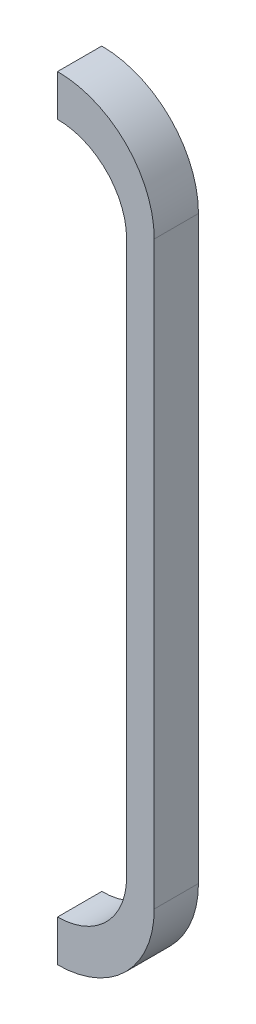
ISO-10303-21;
HEADER;
FILE_DESCRIPTION(('STEP AP214'),'2;1');
FILE_NAME('part.step','',(''),(''),'','','');
FILE_SCHEMA(('AUTOMOTIVE_DESIGN { 1 0 10303 214 1 1 1 1 }'));
ENDSEC;
DATA;
#1=APPLICATION_CONTEXT('core data for automotive mechanical design processes');
#2=APPLICATION_PROTOCOL_DEFINITION('international standard','automotive_design',2000,#1);
#3=PRODUCT_CONTEXT('',#1,'mechanical');
#4=PRODUCT('Part','Part','',(#3));
#5=PRODUCT_RELATED_PRODUCT_CATEGORY('part','',(#4));
#6=PRODUCT_DEFINITION_FORMATION('','',#4);
#7=PRODUCT_DEFINITION_CONTEXT('part definition',#1,'design');
#8=PRODUCT_DEFINITION('design','',#6,#7);
#9=PRODUCT_DEFINITION_SHAPE('','',#8);
#10=(LENGTH_UNIT() NAMED_UNIT(*) SI_UNIT(.MILLI.,.METRE.));
#11=(NAMED_UNIT(*) PLANE_ANGLE_UNIT() SI_UNIT($,.RADIAN.));
#12=(NAMED_UNIT(*) SI_UNIT($,.STERADIAN.) SOLID_ANGLE_UNIT());
#13=UNCERTAINTY_MEASURE_WITH_UNIT(LENGTH_MEASURE(1.E-05),#10,'distance_accuracy_value','');
#14=(GEOMETRIC_REPRESENTATION_CONTEXT(3) GLOBAL_UNCERTAINTY_ASSIGNED_CONTEXT((#13)) GLOBAL_UNIT_ASSIGNED_CONTEXT((#10,
#11,#12)) REPRESENTATION_CONTEXT('',''));
#15=CARTESIAN_POINT('',(0.,0.,0.));
#16=DIRECTION('',(0.,0.,1.));
#17=DIRECTION('',(1.,0.,0.));
#18=AXIS2_PLACEMENT_3D('',#15,#16,#17);
#19=CARTESIAN_POINT('',(10.,-10.5,1.6));
#20=DIRECTION('',(0.,0.,-1.));
#21=DIRECTION('',(-1.,0.,0.));
#22=AXIS2_PLACEMENT_3D('',#19,#20,#21);
#23=CYLINDRICAL_SURFACE('',#22,3.5);
#24=CARTESIAN_POINT('',(10.,-10.5,0.));
#25=DIRECTION('',(0.,0.,1.));
#26=DIRECTION('',(1.,0.,0.));
#27=AXIS2_PLACEMENT_3D('',#24,#25,#26);
#28=CIRCLE('',#27,3.5);
#29=CARTESIAN_POINT('',(9.99999999999997,-14.,0.));
#30=VERTEX_POINT('',#29);
#31=CARTESIAN_POINT('',(13.5,-10.5,0.));
#32=VERTEX_POINT('',#31);
#33=EDGE_CURVE('E129',#30,#32,#28,.T.);
#34=ORIENTED_EDGE('',*,*,#33,.T.);
#35=DIRECTION('',(0.,0.,-1.));
#36=VECTOR('',#35,1.);
#37=CARTESIAN_POINT('',(13.5,-10.5,1.6));
#38=LINE('',#37,#36);
#39=CARTESIAN_POINT('',(13.5,-10.5,1.6));
#40=VERTEX_POINT('',#39);
#41=EDGE_CURVE('E11',#40,#32,#38,.T.);
#42=ORIENTED_EDGE('',*,*,#41,.F.);
#43=CARTESIAN_POINT('',(10.,-10.5,1.6));
#44=DIRECTION('',(0.,0.,1.));
#45=DIRECTION('',(1.,0.,0.));
#46=AXIS2_PLACEMENT_3D('',#43,#44,#45);
#47=CIRCLE('',#46,3.5);
#48=CARTESIAN_POINT('',(9.99999999999997,-14.,1.6));
#49=VERTEX_POINT('',#48);
#50=EDGE_CURVE('E143',#49,#40,#47,.T.);
#51=ORIENTED_EDGE('',*,*,#50,.F.);
#52=DIRECTION('',(0.,0.,-1.));
#53=VECTOR('',#52,1.);
#54=CARTESIAN_POINT('',(9.99999999999997,-14.,1.6));
#55=LINE('',#54,#53);
#56=EDGE_CURVE('E125',#49,#30,#55,.T.);
#57=ORIENTED_EDGE('',*,*,#56,.T.);
#58=EDGE_LOOP('',(#34,#42,#51,#57));
#59=FACE_BOUND('',#58,.T.);
#60=ADVANCED_FACE('F33',(#59),#23,.T.);
#61=CARTESIAN_POINT('',(13.5,10.5,1.6));
#62=DIRECTION('',(-1.,0.,0.));
#63=DIRECTION('',(0.,-1.,0.));
#64=AXIS2_PLACEMENT_3D('',#61,#62,#63);
#65=PLANE('',#64);
#66=DIRECTION('',(0.,1.,0.));
#67=VECTOR('',#66,1.);
#68=CARTESIAN_POINT('',(13.5,10.5,0.));
#69=LINE('',#68,#67);
#70=CARTESIAN_POINT('',(13.5,10.5,0.));
#71=VERTEX_POINT('',#70);
#72=EDGE_CURVE('E132',#32,#71,#69,.T.);
#73=ORIENTED_EDGE('',*,*,#72,.T.);
#74=DIRECTION('',(0.,0.,-1.));
#75=VECTOR('',#74,1.);
#76=CARTESIAN_POINT('',(13.5,10.5,1.6));
#77=LINE('',#76,#75);
#78=CARTESIAN_POINT('',(13.5,10.5,1.6));
#79=VERTEX_POINT('',#78);
#80=EDGE_CURVE('E41',#79,#71,#77,.T.);
#81=ORIENTED_EDGE('',*,*,#80,.F.);
#82=DIRECTION('',(0.,1.,0.));
#83=VECTOR('',#82,1.);
#84=CARTESIAN_POINT('',(13.5,10.5,1.6));
#85=LINE('',#84,#83);
#86=EDGE_CURVE('E92',#40,#79,#85,.T.);
#87=ORIENTED_EDGE('',*,*,#86,.F.);
#88=ORIENTED_EDGE('',*,*,#41,.T.);
#89=EDGE_LOOP('',(#73,#81,#87,#88));
#90=FACE_BOUND('',#89,.T.);
#91=ADVANCED_FACE('F178',(#90),#65,.F.);
#92=CARTESIAN_POINT('',(10.,10.5,1.6));
#93=DIRECTION('',(0.,0.,-1.));
#94=DIRECTION('',(-1.,0.,0.));
#95=AXIS2_PLACEMENT_3D('',#92,#93,#94);
#96=CYLINDRICAL_SURFACE('',#95,3.5);
#97=CARTESIAN_POINT('',(10.,10.5,0.));
#98=DIRECTION('',(0.,0.,1.));
#99=DIRECTION('',(1.,0.,0.));
#100=AXIS2_PLACEMENT_3D('',#97,#98,#99);
#101=CIRCLE('',#100,3.5);
#102=CARTESIAN_POINT('',(10.,14.,0.));
#103=VERTEX_POINT('',#102);
#104=EDGE_CURVE('E134',#71,#103,#101,.T.);
#105=ORIENTED_EDGE('',*,*,#104,.T.);
#106=DIRECTION('',(0.,0.,-1.));
#107=VECTOR('',#106,1.);
#108=CARTESIAN_POINT('',(10.,14.,1.6));
#109=LINE('',#108,#107);
#110=CARTESIAN_POINT('',(10.,14.,1.6));
#111=VERTEX_POINT('',#110);
#112=EDGE_CURVE('E150',#111,#103,#109,.T.);
#113=ORIENTED_EDGE('',*,*,#112,.F.);
#114=CARTESIAN_POINT('',(10.,10.5,1.6));
#115=DIRECTION('',(0.,0.,1.));
#116=DIRECTION('',(1.,0.,0.));
#117=AXIS2_PLACEMENT_3D('',#114,#115,#116);
#118=CIRCLE('',#117,3.5);
#119=EDGE_CURVE('E158',#79,#111,#118,.T.);
#120=ORIENTED_EDGE('',*,*,#119,.F.);
#121=ORIENTED_EDGE('',*,*,#80,.T.);
#122=EDGE_LOOP('',(#105,#113,#120,#121));
#123=FACE_BOUND('',#122,.T.);
#124=ADVANCED_FACE('F156',(#123),#96,.T.);
#125=CARTESIAN_POINT('',(10.,12.5,1.6));
#126=DIRECTION('',(1.,0.,0.));
#127=DIRECTION('',(0.,1.,0.));
#128=AXIS2_PLACEMENT_3D('',#125,#126,#127);
#129=PLANE('',#128);
#130=DIRECTION('',(0.,-1.,0.));
#131=VECTOR('',#130,1.);
#132=CARTESIAN_POINT('',(10.,12.5,0.));
#133=LINE('',#132,#131);
#134=CARTESIAN_POINT('',(10.,12.5,0.));
#135=VERTEX_POINT('',#134);
#136=EDGE_CURVE('E136',#103,#135,#133,.T.);
#137=ORIENTED_EDGE('',*,*,#136,.T.);
#138=DIRECTION('',(0.,0.,-1.));
#139=VECTOR('',#138,1.);
#140=CARTESIAN_POINT('',(10.,12.5,1.6));
#141=LINE('',#140,#139);
#142=CARTESIAN_POINT('',(10.,12.5,1.6));
#143=VERTEX_POINT('',#142);
#144=EDGE_CURVE('E147',#143,#135,#141,.T.);
#145=ORIENTED_EDGE('',*,*,#144,.F.);
#146=DIRECTION('',(0.,-1.,0.));
#147=VECTOR('',#146,1.);
#148=CARTESIAN_POINT('',(10.,12.5,1.6));
#149=LINE('',#148,#147);
#150=EDGE_CURVE('E170',#111,#143,#149,.T.);
#151=ORIENTED_EDGE('',*,*,#150,.F.);
#152=ORIENTED_EDGE('',*,*,#112,.T.);
#153=EDGE_LOOP('',(#137,#145,#151,#152));
#154=FACE_BOUND('',#153,.T.);
#155=ADVANCED_FACE('F166',(#154),#129,.F.);
#156=CARTESIAN_POINT('',(10.,10.,1.6));
#157=DIRECTION('',(0.,0.,-1.));
#158=DIRECTION('',(-1.,0.,0.));
#159=AXIS2_PLACEMENT_3D('',#156,#157,#158);
#160=CYLINDRICAL_SURFACE('',#159,2.5);
#161=CARTESIAN_POINT('',(10.,10.,0.));
#162=DIRECTION('',(0.,0.,-1.));
#163=DIRECTION('',(1.,0.,0.));
#164=AXIS2_PLACEMENT_3D('',#161,#162,#163);
#165=CIRCLE('',#164,2.5);
#166=CARTESIAN_POINT('',(12.5,10.,0.));
#167=VERTEX_POINT('',#166);
#168=EDGE_CURVE('E138',#135,#167,#165,.T.);
#169=ORIENTED_EDGE('',*,*,#168,.T.);
#170=DIRECTION('',(0.,0.,-1.));
#171=VECTOR('',#170,1.);
#172=CARTESIAN_POINT('',(12.5,10.,1.6));
#173=LINE('',#172,#171);
#174=CARTESIAN_POINT('',(12.5,10.,1.6));
#175=VERTEX_POINT('',#174);
#176=EDGE_CURVE('E120',#175,#167,#173,.T.);
#177=ORIENTED_EDGE('',*,*,#176,.F.);
#178=CARTESIAN_POINT('',(10.,10.,1.6));
#179=DIRECTION('',(0.,0.,-1.));
#180=DIRECTION('',(1.,0.,0.));
#181=AXIS2_PLACEMENT_3D('',#178,#179,#180);
#182=CIRCLE('',#181,2.5);
#183=EDGE_CURVE('E111',#143,#175,#182,.T.);
#184=ORIENTED_EDGE('',*,*,#183,.F.);
#185=ORIENTED_EDGE('',*,*,#144,.T.);
#186=EDGE_LOOP('',(#169,#177,#184,#185));
#187=FACE_BOUND('',#186,.T.);
#188=ADVANCED_FACE('F169',(#187),#160,.F.);
#189=CARTESIAN_POINT('',(12.5,-10.,1.6));
#190=DIRECTION('',(1.,0.,0.));
#191=DIRECTION('',(0.,1.,0.));
#192=AXIS2_PLACEMENT_3D('',#189,#190,#191);
#193=PLANE('',#192);
#194=DIRECTION('',(0.,-1.,0.));
#195=VECTOR('',#194,1.);
#196=CARTESIAN_POINT('',(12.5,-10.,0.));
#197=LINE('',#196,#195);
#198=CARTESIAN_POINT('',(12.5,-10.,0.));
#199=VERTEX_POINT('',#198);
#200=EDGE_CURVE('E119',#167,#199,#197,.T.);
#201=ORIENTED_EDGE('',*,*,#200,.T.);
#202=DIRECTION('',(0.,0.,-1.));
#203=VECTOR('',#202,1.);
#204=CARTESIAN_POINT('',(12.5,-10.,1.6));
#205=LINE('',#204,#203);
#206=CARTESIAN_POINT('',(12.5,-10.,1.6));
#207=VERTEX_POINT('',#206);
#208=EDGE_CURVE('E116',#207,#199,#205,.T.);
#209=ORIENTED_EDGE('',*,*,#208,.F.);
#210=DIRECTION('',(0.,-1.,0.));
#211=VECTOR('',#210,1.);
#212=CARTESIAN_POINT('',(12.5,-10.,1.6));
#213=LINE('',#212,#211);
#214=EDGE_CURVE('E105',#175,#207,#213,.T.);
#215=ORIENTED_EDGE('',*,*,#214,.F.);
#216=ORIENTED_EDGE('',*,*,#176,.T.);
#217=EDGE_LOOP('',(#201,#209,#215,#216));
#218=FACE_BOUND('',#217,.T.);
#219=ADVANCED_FACE('F117',(#218),#193,.F.);
#220=CARTESIAN_POINT('',(10.,-10.,1.6));
#221=DIRECTION('',(0.,0.,-1.));
#222=DIRECTION('',(-1.,0.,0.));
#223=AXIS2_PLACEMENT_3D('',#220,#221,#222);
#224=CYLINDRICAL_SURFACE('',#223,2.5);
#225=CARTESIAN_POINT('',(10.,-10.,0.));
#226=DIRECTION('',(0.,0.,-1.));
#227=DIRECTION('',(1.,0.,0.));
#228=AXIS2_PLACEMENT_3D('',#225,#226,#227);
#229=CIRCLE('',#228,2.5);
#230=CARTESIAN_POINT('',(10.,-12.5,0.));
#231=VERTEX_POINT('',#230);
#232=EDGE_CURVE('E78',#199,#231,#229,.T.);
#233=ORIENTED_EDGE('',*,*,#232,.T.);
#234=DIRECTION('',(0.,0.,-1.));
#235=VECTOR('',#234,1.);
#236=CARTESIAN_POINT('',(10.,-12.5,1.6));
#237=LINE('',#236,#235);
#238=CARTESIAN_POINT('',(10.,-12.5,1.6));
#239=VERTEX_POINT('',#238);
#240=EDGE_CURVE('E121',#239,#231,#237,.T.);
#241=ORIENTED_EDGE('',*,*,#240,.F.);
#242=CARTESIAN_POINT('',(10.,-10.,1.6));
#243=DIRECTION('',(0.,0.,-1.));
#244=DIRECTION('',(1.,0.,0.));
#245=AXIS2_PLACEMENT_3D('',#242,#243,#244);
#246=CIRCLE('',#245,2.5);
#247=EDGE_CURVE('E109',#207,#239,#246,.T.);
#248=ORIENTED_EDGE('',*,*,#247,.F.);
#249=ORIENTED_EDGE('',*,*,#208,.T.);
#250=EDGE_LOOP('',(#233,#241,#248,#249));
#251=FACE_BOUND('',#250,.T.);
#252=ADVANCED_FACE('F123',(#251),#224,.F.);
#253=CARTESIAN_POINT('',(9.99999999999997,-14.,1.6));
#254=DIRECTION('',(1.,0.,0.));
#255=DIRECTION('',(0.,1.,0.));
#256=AXIS2_PLACEMENT_3D('',#253,#254,#255);
#257=PLANE('',#256);
#258=DIRECTION('',(0.,-1.,0.));
#259=VECTOR('',#258,1.);
#260=CARTESIAN_POINT('',(9.99999999999997,-14.,0.));
#261=LINE('',#260,#259);
#262=EDGE_CURVE('E84',#231,#30,#261,.T.);
#263=ORIENTED_EDGE('',*,*,#262,.T.);
#264=ORIENTED_EDGE('',*,*,#56,.F.);
#265=DIRECTION('',(0.,-1.,0.));
#266=VECTOR('',#265,1.);
#267=CARTESIAN_POINT('',(9.99999999999997,-14.,1.6));
#268=LINE('',#267,#266);
#269=EDGE_CURVE('E49',#239,#49,#268,.T.);
#270=ORIENTED_EDGE('',*,*,#269,.F.);
#271=ORIENTED_EDGE('',*,*,#240,.T.);
#272=EDGE_LOOP('',(#263,#264,#270,#271));
#273=FACE_BOUND('',#272,.T.);
#274=ADVANCED_FACE('F194',(#273),#257,.F.);
#275=CARTESIAN_POINT('',(10.,-10.5,1.6));
#276=DIRECTION('',(0.,0.,1.));
#277=DIRECTION('',(1.,0.,0.));
#278=AXIS2_PLACEMENT_3D('',#275,#276,#277);
#279=PLANE('',#278);
#280=ORIENTED_EDGE('',*,*,#50,.T.);
#281=ORIENTED_EDGE('',*,*,#86,.T.);
#282=ORIENTED_EDGE('',*,*,#119,.T.);
#283=ORIENTED_EDGE('',*,*,#150,.T.);
#284=ORIENTED_EDGE('',*,*,#183,.T.);
#285=ORIENTED_EDGE('',*,*,#214,.T.);
#286=ORIENTED_EDGE('',*,*,#247,.T.);
#287=ORIENTED_EDGE('',*,*,#269,.T.);
#288=EDGE_LOOP('',(#280,#281,#282,#283,#284,#285,#286,#287));
#289=FACE_BOUND('',#288,.T.);
#290=ADVANCED_FACE('F107',(#289),#279,.T.);
#291=CARTESIAN_POINT('',(10.,-10.5,0.));
#292=DIRECTION('',(0.,0.,1.));
#293=DIRECTION('',(1.,0.,0.));
#294=AXIS2_PLACEMENT_3D('',#291,#292,#293);
#295=PLANE('',#294);
#296=ORIENTED_EDGE('',*,*,#33,.F.);
#297=ORIENTED_EDGE('',*,*,#262,.F.);
#298=ORIENTED_EDGE('',*,*,#232,.F.);
#299=ORIENTED_EDGE('',*,*,#200,.F.);
#300=ORIENTED_EDGE('',*,*,#168,.F.);
#301=ORIENTED_EDGE('',*,*,#136,.F.);
#302=ORIENTED_EDGE('',*,*,#104,.F.);
#303=ORIENTED_EDGE('',*,*,#72,.F.);
#304=EDGE_LOOP('',(#296,#297,#298,#299,#300,#301,#302,#303));
#305=FACE_BOUND('',#304,.T.);
#306=ADVANCED_FACE('F162',(#305),#295,.F.);
#307=CLOSED_SHELL('',(#60,#91,#124,#155,#188,#219,#252,#274,#290,#306));
#308=MANIFOLD_SOLID_BREP('B2',#307);
#309=ADVANCED_BREP_SHAPE_REPRESENTATION('',(#18,#308),#14);
#310=SHAPE_DEFINITION_REPRESENTATION(#9,#309);
ENDSEC;
END-ISO-10303-21;
